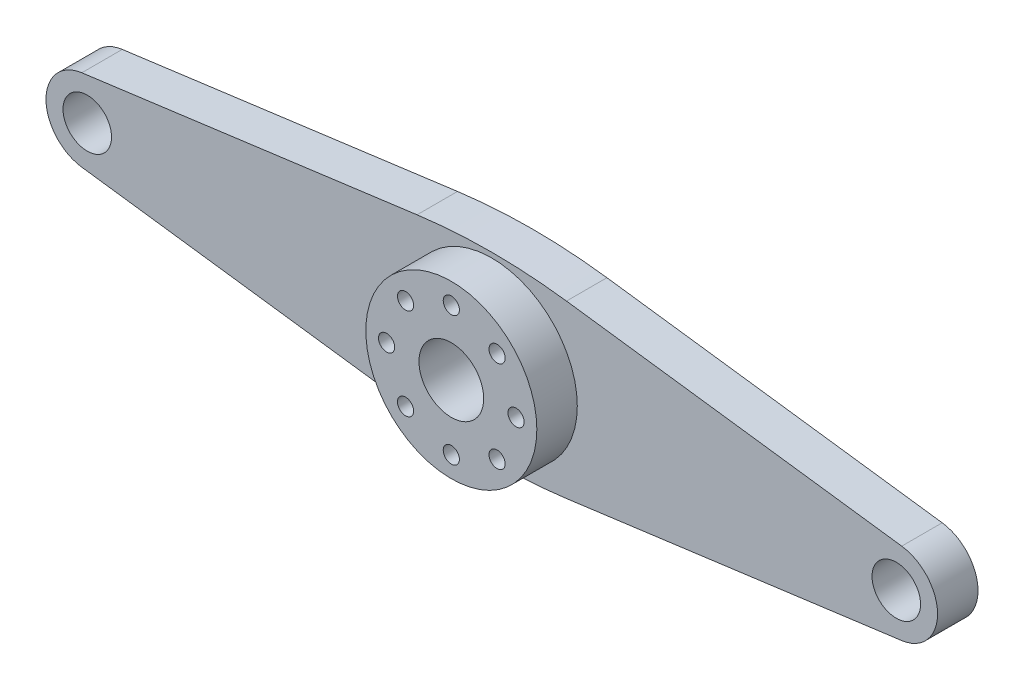
ISO-10303-21;
HEADER;
FILE_DESCRIPTION(('STEP AP214'),'2;1');
FILE_NAME('part.step','',(''),(''),'','','');
FILE_SCHEMA(('AUTOMOTIVE_DESIGN { 1 0 10303 214 1 1 1 1 }'));
ENDSEC;
DATA;
#1=APPLICATION_CONTEXT('core data for automotive mechanical design processes');
#2=APPLICATION_PROTOCOL_DEFINITION('international standard','automotive_design',2000,#1);
#3=PRODUCT_CONTEXT('',#1,'mechanical');
#4=PRODUCT('Part','Part','',(#3));
#5=PRODUCT_RELATED_PRODUCT_CATEGORY('part','',(#4));
#6=PRODUCT_DEFINITION_FORMATION('','',#4);
#7=PRODUCT_DEFINITION_CONTEXT('part definition',#1,'design');
#8=PRODUCT_DEFINITION('design','',#6,#7);
#9=PRODUCT_DEFINITION_SHAPE('','',#8);
#10=(LENGTH_UNIT() NAMED_UNIT(*) SI_UNIT(.MILLI.,.METRE.));
#11=(NAMED_UNIT(*) PLANE_ANGLE_UNIT() SI_UNIT($,.RADIAN.));
#12=(NAMED_UNIT(*) SI_UNIT($,.STERADIAN.) SOLID_ANGLE_UNIT());
#13=UNCERTAINTY_MEASURE_WITH_UNIT(LENGTH_MEASURE(1.E-05),#10,'distance_accuracy_value','');
#14=(GEOMETRIC_REPRESENTATION_CONTEXT(3) GLOBAL_UNCERTAINTY_ASSIGNED_CONTEXT((#13)) GLOBAL_UNIT_ASSIGNED_CONTEXT((#10,
#11,#12)) REPRESENTATION_CONTEXT('',''));
#15=CARTESIAN_POINT('',(0.,0.,0.));
#16=DIRECTION('',(0.,0.,1.));
#17=DIRECTION('',(1.,0.,0.));
#18=AXIS2_PLACEMENT_3D('',#15,#16,#17);
#19=CARTESIAN_POINT('',(-1.54315479575544,-11.5945134987938,5.));
#20=DIRECTION('',(0.131930166805804,0.991259013117456,0.));
#21=DIRECTION('',(-0.991259013117456,0.131930166805804,0.));
#22=AXIS2_PLACEMENT_3D('',#19,#20,#21);
#23=PLANE('',#22);
#24=DIRECTION('',(0.991259013117456,-0.131930166805804,0.));
#25=VECTOR('',#24,1.);
#26=CARTESIAN_POINT('',(-1.54315479575544,-11.5945134987938,0.));
#27=LINE('',#26,#25);
#28=CARTESIAN_POINT('',(-50.6728763500851,-5.05566515137672,0.));
#29=VERTEX_POINT('',#28);
#30=CARTESIAN_POINT('',(-9.23511167640649,-10.5707637614413,0.));
#31=VERTEX_POINT('',#30);
#32=EDGE_CURVE('E137',#29,#31,#27,.T.);
#33=ORIENTED_EDGE('',*,*,#32,.T.);
#34=DIRECTION('',(0.,0.,-1.));
#35=VECTOR('',#34,1.);
#36=CARTESIAN_POINT('',(-9.23511167640649,-10.5707637614413,5.));
#37=LINE('',#36,#35);
#38=CARTESIAN_POINT('',(-9.23511167640649,-10.5707637614413,5.));
#39=VERTEX_POINT('',#38);
#40=EDGE_CURVE('E11',#39,#31,#37,.T.);
#41=ORIENTED_EDGE('',*,*,#40,.F.);
#42=DIRECTION('',(0.991259013117456,-0.131930166805804,0.));
#43=VECTOR('',#42,1.);
#44=CARTESIAN_POINT('',(-1.54315479575544,-11.5945134987938,5.));
#45=LINE('',#44,#43);
#46=CARTESIAN_POINT('',(-50.6728763500851,-5.05566515137672,5.));
#47=VERTEX_POINT('',#46);
#48=EDGE_CURVE('E210',#47,#39,#45,.T.);
#49=ORIENTED_EDGE('',*,*,#48,.F.);
#50=DIRECTION('',(0.,0.,-1.));
#51=VECTOR('',#50,1.);
#52=CARTESIAN_POINT('',(-50.6728763500851,-5.05566515137672,5.));
#53=LINE('',#52,#51);
#54=EDGE_CURVE('E126',#47,#29,#53,.T.);
#55=ORIENTED_EDGE('',*,*,#54,.T.);
#56=EDGE_LOOP('',(#33,#41,#49,#55));
#57=FACE_BOUND('',#56,.T.);
#58=ADVANCED_FACE('F34',(#57),#23,.F.);
#59=CARTESIAN_POINT('',(0.,58.8173671567806,5.));
#60=DIRECTION('',(0.,0.,-1.));
#61=DIRECTION('',(-1.,0.,0.));
#62=AXIS2_PLACEMENT_3D('',#59,#60,#61);
#63=CYLINDRICAL_SURFACE('',#62,70.);
#64=CARTESIAN_POINT('',(0.,58.8173671567806,0.));
#65=DIRECTION('',(0.,0.,1.));
#66=DIRECTION('',(1.,0.,0.));
#67=AXIS2_PLACEMENT_3D('',#64,#65,#66);
#68=CIRCLE('',#67,70.);
#69=CARTESIAN_POINT('',(9.23511167640649,-10.5707637614413,0.));
#70=VERTEX_POINT('',#69);
#71=EDGE_CURVE('E140',#31,#70,#68,.T.);
#72=ORIENTED_EDGE('',*,*,#71,.T.);
#73=DIRECTION('',(0.,0.,-1.));
#74=VECTOR('',#73,1.);
#75=CARTESIAN_POINT('',(9.23511167640649,-10.5707637614413,5.));
#76=LINE('',#75,#74);
#77=CARTESIAN_POINT('',(9.23511167640649,-10.5707637614413,5.));
#78=VERTEX_POINT('',#77);
#79=EDGE_CURVE('E43',#78,#70,#76,.T.);
#80=ORIENTED_EDGE('',*,*,#79,.F.);
#81=CARTESIAN_POINT('',(0.,58.8173671567806,5.));
#82=DIRECTION('',(0.,0.,1.));
#83=DIRECTION('',(1.,0.,0.));
#84=AXIS2_PLACEMENT_3D('',#81,#82,#83);
#85=CIRCLE('',#84,70.);
#86=EDGE_CURVE('E90',#39,#78,#85,.T.);
#87=ORIENTED_EDGE('',*,*,#86,.F.);
#88=ORIENTED_EDGE('',*,*,#40,.T.);
#89=EDGE_LOOP('',(#72,#80,#87,#88));
#90=FACE_BOUND('',#89,.T.);
#91=ADVANCED_FACE('F196',(#90),#63,.T.);
#92=CARTESIAN_POINT('',(1.54315479575544,-11.5945134987938,5.));
#93=DIRECTION('',(0.131930166805804,-0.991259013117456,0.));
#94=DIRECTION('',(0.991259013117456,0.131930166805804,0.));
#95=AXIS2_PLACEMENT_3D('',#92,#93,#94);
#96=PLANE('',#95);
#97=DIRECTION('',(-0.991259013117456,-0.131930166805804,0.));
#98=VECTOR('',#97,1.);
#99=CARTESIAN_POINT('',(1.54315479575544,-11.5945134987938,0.));
#100=LINE('',#99,#98);
#101=CARTESIAN_POINT('',(50.6728763500851,-5.05566515137672,0.));
#102=VERTEX_POINT('',#101);
#103=EDGE_CURVE('E143',#102,#70,#100,.T.);
#104=ORIENTED_EDGE('',*,*,#103,.F.);
#105=DIRECTION('',(0.,0.,-1.));
#106=VECTOR('',#105,1.);
#107=CARTESIAN_POINT('',(50.6728763500851,-5.05566515137672,5.));
#108=LINE('',#107,#106);
#109=CARTESIAN_POINT('',(50.6728763500851,-5.05566515137672,5.));
#110=VERTEX_POINT('',#109);
#111=EDGE_CURVE('E189',#110,#102,#108,.T.);
#112=ORIENTED_EDGE('',*,*,#111,.F.);
#113=DIRECTION('',(-0.991259013117456,-0.131930166805804,0.));
#114=VECTOR('',#113,1.);
#115=CARTESIAN_POINT('',(1.54315479575544,-11.5945134987938,5.));
#116=LINE('',#115,#114);
#117=EDGE_CURVE('E195',#110,#78,#116,.T.);
#118=ORIENTED_EDGE('',*,*,#117,.T.);
#119=ORIENTED_EDGE('',*,*,#79,.T.);
#120=EDGE_LOOP('',(#104,#112,#118,#119));
#121=FACE_BOUND('',#120,.T.);
#122=ADVANCED_FACE('F193',(#121),#96,.T.);
#123=CARTESIAN_POINT('',(50.,0.,5.));
#124=DIRECTION('',(0.,0.,-1.));
#125=DIRECTION('',(-1.,0.,0.));
#126=AXIS2_PLACEMENT_3D('',#123,#124,#125);
#127=CYLINDRICAL_SURFACE('',#126,5.10024633771241);
#128=CARTESIAN_POINT('',(50.,0.,0.));
#129=DIRECTION('',(0.,0.,1.));
#130=DIRECTION('',(1.,0.,0.));
#131=AXIS2_PLACEMENT_3D('',#128,#129,#130);
#132=CIRCLE('',#131,5.10024633771241);
#133=CARTESIAN_POINT('',(50.6728763500851,5.05566515137672,0.));
#134=VERTEX_POINT('',#133);
#135=EDGE_CURVE('E146',#134,#102,#132,.F.);
#136=ORIENTED_EDGE('',*,*,#135,.F.);
#137=DIRECTION('',(0.,0.,-1.));
#138=VECTOR('',#137,1.);
#139=CARTESIAN_POINT('',(50.6728763500851,5.05566515137672,5.));
#140=LINE('',#139,#138);
#141=CARTESIAN_POINT('',(50.6728763500851,5.05566515137672,5.));
#142=VERTEX_POINT('',#141);
#143=EDGE_CURVE('E187',#142,#134,#140,.T.);
#144=ORIENTED_EDGE('',*,*,#143,.F.);
#145=CARTESIAN_POINT('',(50.,0.,5.));
#146=DIRECTION('',(0.,0.,1.));
#147=DIRECTION('',(1.,0.,0.));
#148=AXIS2_PLACEMENT_3D('',#145,#146,#147);
#149=CIRCLE('',#148,5.10024633771241);
#150=EDGE_CURVE('E207',#142,#110,#149,.F.);
#151=ORIENTED_EDGE('',*,*,#150,.T.);
#152=ORIENTED_EDGE('',*,*,#111,.T.);
#153=EDGE_LOOP('',(#136,#144,#151,#152));
#154=FACE_BOUND('',#153,.T.);
#155=ADVANCED_FACE('F205',(#154),#127,.T.);
#156=CARTESIAN_POINT('',(1.54315479575544,11.5945134987938,5.));
#157=DIRECTION('',(-0.131930166805804,-0.991259013117456,0.));
#158=DIRECTION('',(0.991259013117456,-0.131930166805804,0.));
#159=AXIS2_PLACEMENT_3D('',#156,#157,#158);
#160=PLANE('',#159);
#161=DIRECTION('',(-0.991259013117456,0.131930166805804,0.));
#162=VECTOR('',#161,1.);
#163=CARTESIAN_POINT('',(1.54315479575544,11.5945134987938,0.));
#164=LINE('',#163,#162);
#165=CARTESIAN_POINT('',(9.23511167640649,10.5707637614413,0.));
#166=VERTEX_POINT('',#165);
#167=EDGE_CURVE('E149',#134,#166,#164,.T.);
#168=ORIENTED_EDGE('',*,*,#167,.T.);
#169=DIRECTION('',(0.,0.,-1.));
#170=VECTOR('',#169,1.);
#171=CARTESIAN_POINT('',(9.23511167640649,10.5707637614413,5.));
#172=LINE('',#171,#170);
#173=CARTESIAN_POINT('',(9.23511167640649,10.5707637614413,5.));
#174=VERTEX_POINT('',#173);
#175=EDGE_CURVE('E115',#174,#166,#172,.T.);
#176=ORIENTED_EDGE('',*,*,#175,.F.);
#177=DIRECTION('',(-0.991259013117456,0.131930166805804,0.));
#178=VECTOR('',#177,1.);
#179=CARTESIAN_POINT('',(1.54315479575544,11.5945134987938,5.));
#180=LINE('',#179,#178);
#181=EDGE_CURVE('E121',#142,#174,#180,.T.);
#182=ORIENTED_EDGE('',*,*,#181,.F.);
#183=ORIENTED_EDGE('',*,*,#143,.T.);
#184=EDGE_LOOP('',(#168,#176,#182,#183));
#185=FACE_BOUND('',#184,.T.);
#186=ADVANCED_FACE('F355',(#185),#160,.F.);
#187=CARTESIAN_POINT('',(0.,-58.8173671567806,5.));
#188=DIRECTION('',(0.,0.,-1.));
#189=DIRECTION('',(-1.,0.,0.));
#190=AXIS2_PLACEMENT_3D('',#187,#188,#189);
#191=CYLINDRICAL_SURFACE('',#190,70.);
#192=CARTESIAN_POINT('',(0.,-58.8173671567806,0.));
#193=DIRECTION('',(0.,0.,1.));
#194=DIRECTION('',(1.,0.,0.));
#195=AXIS2_PLACEMENT_3D('',#192,#193,#194);
#196=CIRCLE('',#195,70.);
#197=CARTESIAN_POINT('',(-9.23511167640649,10.5707637614413,0.));
#198=VERTEX_POINT('',#197);
#199=EDGE_CURVE('E110',#198,#166,#196,.F.);
#200=ORIENTED_EDGE('',*,*,#199,.F.);
#201=DIRECTION('',(0.,0.,-1.));
#202=VECTOR('',#201,1.);
#203=CARTESIAN_POINT('',(-9.23511167640649,10.5707637614413,5.));
#204=LINE('',#203,#202);
#205=CARTESIAN_POINT('',(-9.23511167640649,10.5707637614413,5.));
#206=VERTEX_POINT('',#205);
#207=EDGE_CURVE('E105',#206,#198,#204,.T.);
#208=ORIENTED_EDGE('',*,*,#207,.F.);
#209=CARTESIAN_POINT('',(0.,-58.8173671567806,5.));
#210=DIRECTION('',(0.,0.,1.));
#211=DIRECTION('',(1.,0.,0.));
#212=AXIS2_PLACEMENT_3D('',#209,#210,#211);
#213=CIRCLE('',#212,70.);
#214=EDGE_CURVE('E108',#206,#174,#213,.F.);
#215=ORIENTED_EDGE('',*,*,#214,.T.);
#216=ORIENTED_EDGE('',*,*,#175,.T.);
#217=EDGE_LOOP('',(#200,#208,#215,#216));
#218=FACE_BOUND('',#217,.T.);
#219=ADVANCED_FACE('F107',(#218),#191,.T.);
#220=CARTESIAN_POINT('',(-1.54315479575544,11.5945134987938,5.));
#221=DIRECTION('',(-0.131930166805804,0.991259013117456,0.));
#222=DIRECTION('',(-0.991259013117456,-0.131930166805804,0.));
#223=AXIS2_PLACEMENT_3D('',#220,#221,#222);
#224=PLANE('',#223);
#225=DIRECTION('',(0.991259013117456,0.131930166805804,0.));
#226=VECTOR('',#225,1.);
#227=CARTESIAN_POINT('',(-1.54315479575544,11.5945134987938,0.));
#228=LINE('',#227,#226);
#229=CARTESIAN_POINT('',(-50.6728763500851,5.05566515137672,0.));
#230=VERTEX_POINT('',#229);
#231=EDGE_CURVE('E153',#230,#198,#228,.T.);
#232=ORIENTED_EDGE('',*,*,#231,.F.);
#233=DIRECTION('',(0.,0.,-1.));
#234=VECTOR('',#233,1.);
#235=CARTESIAN_POINT('',(-50.6728763500851,5.05566515137672,5.));
#236=LINE('',#235,#234);
#237=CARTESIAN_POINT('',(-50.6728763500851,5.05566515137672,5.));
#238=VERTEX_POINT('',#237);
#239=EDGE_CURVE('E79',#238,#230,#236,.T.);
#240=ORIENTED_EDGE('',*,*,#239,.F.);
#241=DIRECTION('',(0.991259013117456,0.131930166805804,0.));
#242=VECTOR('',#241,1.);
#243=CARTESIAN_POINT('',(-1.54315479575544,11.5945134987938,5.));
#244=LINE('',#243,#242);
#245=EDGE_CURVE('E118',#238,#206,#244,.T.);
#246=ORIENTED_EDGE('',*,*,#245,.T.);
#247=ORIENTED_EDGE('',*,*,#207,.T.);
#248=EDGE_LOOP('',(#232,#240,#246,#247));
#249=FACE_BOUND('',#248,.T.);
#250=ADVANCED_FACE('F124',(#249),#224,.T.);
#251=CARTESIAN_POINT('',(0.,-8.,5.));
#252=DIRECTION('',(0.,0.,-1.));
#253=DIRECTION('',(-1.,0.,0.));
#254=AXIS2_PLACEMENT_3D('',#251,#252,#253);
#255=CYLINDRICAL_SURFACE('',#254,1.);
#256=CARTESIAN_POINT('',(0.,-8.,0.));
#257=DIRECTION('',(0.,0.,1.));
#258=DIRECTION('',(1.,0.,0.));
#259=AXIS2_PLACEMENT_3D('',#256,#257,#258);
#260=CIRCLE('',#259,1.);
#261=CARTESIAN_POINT('',(0.999999999999915,-8.,0.));
#262=VERTEX_POINT('',#261);
#263=EDGE_CURVE('E177',#262,#262,#260,.T.);
#264=ORIENTED_EDGE('',*,*,#263,.F.);
#265=EDGE_LOOP('',(#264));
#266=FACE_BOUND('',#265,.T.);
#267=CARTESIAN_POINT('',(0.,-8.,10.));
#268=DIRECTION('',(0.,0.,1.));
#269=DIRECTION('',(1.,0.,0.));
#270=AXIS2_PLACEMENT_3D('',#267,#268,#269);
#271=CIRCLE('',#270,1.);
#272=CARTESIAN_POINT('',(0.999999999999915,-8.,10.));
#273=VERTEX_POINT('',#272);
#274=EDGE_CURVE('E227',#273,#273,#271,.T.);
#275=ORIENTED_EDGE('',*,*,#274,.T.);
#276=EDGE_LOOP('',(#275));
#277=FACE_BOUND('',#276,.T.);
#278=ADVANCED_FACE('F320',(#266,#277),#255,.F.);
#279=CARTESIAN_POINT('',(5.65685424949233,-5.65685424949243,5.));
#280=DIRECTION('',(0.,0.,-1.));
#281=DIRECTION('',(-1.,0.,0.));
#282=AXIS2_PLACEMENT_3D('',#279,#280,#281);
#283=CYLINDRICAL_SURFACE('',#282,1.);
#284=CARTESIAN_POINT('',(5.65685424949233,-5.65685424949243,0.));
#285=DIRECTION('',(0.,0.,1.));
#286=DIRECTION('',(1.,0.,0.));
#287=AXIS2_PLACEMENT_3D('',#284,#285,#286);
#288=CIRCLE('',#287,1.);
#289=CARTESIAN_POINT('',(6.65685424949233,-5.65685424949243,0.));
#290=VERTEX_POINT('',#289);
#291=EDGE_CURVE('E174',#290,#290,#288,.T.);
#292=ORIENTED_EDGE('',*,*,#291,.F.);
#293=EDGE_LOOP('',(#292));
#294=FACE_BOUND('',#293,.T.);
#295=CARTESIAN_POINT('',(5.65685424949233,-5.65685424949243,10.));
#296=DIRECTION('',(0.,0.,1.));
#297=DIRECTION('',(1.,0.,0.));
#298=AXIS2_PLACEMENT_3D('',#295,#296,#297);
#299=CIRCLE('',#298,1.);
#300=CARTESIAN_POINT('',(6.65685424949233,-5.65685424949243,10.));
#301=VERTEX_POINT('',#300);
#302=EDGE_CURVE('E230',#301,#301,#299,.T.);
#303=ORIENTED_EDGE('',*,*,#302,.T.);
#304=EDGE_LOOP('',(#303));
#305=FACE_BOUND('',#304,.T.);
#306=ADVANCED_FACE('F323',(#294,#305),#283,.F.);
#307=CARTESIAN_POINT('',(8.,0.,5.));
#308=DIRECTION('',(0.,0.,-1.));
#309=DIRECTION('',(-1.,0.,0.));
#310=AXIS2_PLACEMENT_3D('',#307,#308,#309);
#311=CYLINDRICAL_SURFACE('',#310,0.999999999999999);
#312=CARTESIAN_POINT('',(8.,0.,0.));
#313=DIRECTION('',(0.,0.,1.));
#314=DIRECTION('',(1.,0.,0.));
#315=AXIS2_PLACEMENT_3D('',#312,#313,#314);
#316=CIRCLE('',#315,0.999999999999999);
#317=CARTESIAN_POINT('',(9.,0.,0.));
#318=VERTEX_POINT('',#317);
#319=EDGE_CURVE('E171',#318,#318,#316,.T.);
#320=ORIENTED_EDGE('',*,*,#319,.F.);
#321=EDGE_LOOP('',(#320));
#322=FACE_BOUND('',#321,.T.);
#323=CARTESIAN_POINT('',(8.,0.,10.));
#324=DIRECTION('',(0.,0.,1.));
#325=DIRECTION('',(1.,0.,0.));
#326=AXIS2_PLACEMENT_3D('',#323,#324,#325);
#327=CIRCLE('',#326,0.999999999999999);
#328=CARTESIAN_POINT('',(9.,0.,10.));
#329=VERTEX_POINT('',#328);
#330=EDGE_CURVE('E233',#329,#329,#327,.T.);
#331=ORIENTED_EDGE('',*,*,#330,.T.);
#332=EDGE_LOOP('',(#331));
#333=FACE_BOUND('',#332,.T.);
#334=ADVANCED_FACE('F327',(#322,#333),#311,.F.);
#335=CARTESIAN_POINT('',(5.65685424949241,5.65685424949235,5.));
#336=DIRECTION('',(0.,0.,-1.));
#337=DIRECTION('',(-1.,0.,0.));
#338=AXIS2_PLACEMENT_3D('',#335,#336,#337);
#339=CYLINDRICAL_SURFACE('',#338,0.999999999999999);
#340=CARTESIAN_POINT('',(5.65685424949241,5.65685424949235,0.));
#341=DIRECTION('',(0.,0.,1.));
#342=DIRECTION('',(1.,0.,0.));
#343=AXIS2_PLACEMENT_3D('',#340,#341,#342);
#344=CIRCLE('',#343,0.999999999999999);
#345=CARTESIAN_POINT('',(6.65685424949241,5.65685424949235,0.));
#346=VERTEX_POINT('',#345);
#347=EDGE_CURVE('E168',#346,#346,#344,.T.);
#348=ORIENTED_EDGE('',*,*,#347,.F.);
#349=EDGE_LOOP('',(#348));
#350=FACE_BOUND('',#349,.T.);
#351=CARTESIAN_POINT('',(5.65685424949241,5.65685424949235,10.));
#352=DIRECTION('',(0.,0.,1.));
#353=DIRECTION('',(1.,0.,0.));
#354=AXIS2_PLACEMENT_3D('',#351,#352,#353);
#355=CIRCLE('',#354,0.999999999999999);
#356=CARTESIAN_POINT('',(6.65685424949241,5.65685424949235,10.));
#357=VERTEX_POINT('',#356);
#358=EDGE_CURVE('E236',#357,#357,#355,.T.);
#359=ORIENTED_EDGE('',*,*,#358,.T.);
#360=EDGE_LOOP('',(#359));
#361=FACE_BOUND('',#360,.T.);
#362=ADVANCED_FACE('F331',(#350,#361),#339,.F.);
#363=CARTESIAN_POINT('',(0.,8.,5.));
#364=DIRECTION('',(0.,0.,-1.));
#365=DIRECTION('',(-1.,0.,0.));
#366=AXIS2_PLACEMENT_3D('',#363,#364,#365);
#367=CYLINDRICAL_SURFACE('',#366,1.);
#368=CARTESIAN_POINT('',(0.,8.,0.));
#369=DIRECTION('',(0.,0.,1.));
#370=DIRECTION('',(1.,0.,0.));
#371=AXIS2_PLACEMENT_3D('',#368,#369,#370);
#372=CIRCLE('',#371,1.);
#373=CARTESIAN_POINT('',(1.00000000000003,8.,0.));
#374=VERTEX_POINT('',#373);
#375=EDGE_CURVE('E165',#374,#374,#372,.T.);
#376=ORIENTED_EDGE('',*,*,#375,.F.);
#377=EDGE_LOOP('',(#376));
#378=FACE_BOUND('',#377,.T.);
#379=CARTESIAN_POINT('',(0.,8.,10.));
#380=DIRECTION('',(0.,0.,1.));
#381=DIRECTION('',(1.,0.,0.));
#382=AXIS2_PLACEMENT_3D('',#379,#380,#381);
#383=CIRCLE('',#382,1.);
#384=CARTESIAN_POINT('',(1.00000000000003,8.,10.));
#385=VERTEX_POINT('',#384);
#386=EDGE_CURVE('E239',#385,#385,#383,.T.);
#387=ORIENTED_EDGE('',*,*,#386,.T.);
#388=EDGE_LOOP('',(#387));
#389=FACE_BOUND('',#388,.T.);
#390=ADVANCED_FACE('F335',(#378,#389),#367,.F.);
#391=CARTESIAN_POINT('',(-8.,0.,5.));
#392=DIRECTION('',(0.,0.,-1.));
#393=DIRECTION('',(-1.,0.,0.));
#394=AXIS2_PLACEMENT_3D('',#391,#392,#393);
#395=CYLINDRICAL_SURFACE('',#394,1.);
#396=CARTESIAN_POINT('',(-8.,0.,0.));
#397=DIRECTION('',(0.,0.,1.));
#398=DIRECTION('',(1.,0.,0.));
#399=AXIS2_PLACEMENT_3D('',#396,#397,#398);
#400=CIRCLE('',#399,1.);
#401=CARTESIAN_POINT('',(-7.,0.,0.));
#402=VERTEX_POINT('',#401);
#403=EDGE_CURVE('E162',#402,#402,#400,.T.);
#404=ORIENTED_EDGE('',*,*,#403,.F.);
#405=EDGE_LOOP('',(#404));
#406=FACE_BOUND('',#405,.T.);
#407=CARTESIAN_POINT('',(-8.,0.,10.));
#408=DIRECTION('',(0.,0.,1.));
#409=DIRECTION('',(1.,0.,0.));
#410=AXIS2_PLACEMENT_3D('',#407,#408,#409);
#411=CIRCLE('',#410,1.);
#412=CARTESIAN_POINT('',(-7.,0.,10.));
#413=VERTEX_POINT('',#412);
#414=EDGE_CURVE('E242',#413,#413,#411,.T.);
#415=ORIENTED_EDGE('',*,*,#414,.T.);
#416=EDGE_LOOP('',(#415));
#417=FACE_BOUND('',#416,.T.);
#418=ADVANCED_FACE('F339',(#406,#417),#395,.F.);
#419=CARTESIAN_POINT('',(-5.65685424949237,5.65685424949239,5.));
#420=DIRECTION('',(0.,0.,-1.));
#421=DIRECTION('',(-1.,0.,0.));
#422=AXIS2_PLACEMENT_3D('',#419,#420,#421);
#423=CYLINDRICAL_SURFACE('',#422,0.999999999999999);
#424=CARTESIAN_POINT('',(-5.65685424949237,5.65685424949239,0.));
#425=DIRECTION('',(0.,0.,1.));
#426=DIRECTION('',(1.,0.,0.));
#427=AXIS2_PLACEMENT_3D('',#424,#425,#426);
#428=CIRCLE('',#427,0.999999999999999);
#429=CARTESIAN_POINT('',(-4.65685424949237,5.65685424949239,0.));
#430=VERTEX_POINT('',#429);
#431=EDGE_CURVE('E159',#430,#430,#428,.T.);
#432=ORIENTED_EDGE('',*,*,#431,.F.);
#433=EDGE_LOOP('',(#432));
#434=FACE_BOUND('',#433,.T.);
#435=CARTESIAN_POINT('',(-5.65685424949237,5.65685424949239,10.));
#436=DIRECTION('',(0.,0.,1.));
#437=DIRECTION('',(1.,0.,0.));
#438=AXIS2_PLACEMENT_3D('',#435,#436,#437);
#439=CIRCLE('',#438,0.999999999999999);
#440=CARTESIAN_POINT('',(-4.65685424949237,5.65685424949239,10.));
#441=VERTEX_POINT('',#440);
#442=EDGE_CURVE('E245',#441,#441,#439,.T.);
#443=ORIENTED_EDGE('',*,*,#442,.T.);
#444=EDGE_LOOP('',(#443));
#445=FACE_BOUND('',#444,.T.);
#446=ADVANCED_FACE('F343',(#434,#445),#423,.F.);
#447=CARTESIAN_POINT('',(0.,0.,5.));
#448=DIRECTION('',(0.,0.,-1.));
#449=DIRECTION('',(-1.,0.,0.));
#450=AXIS2_PLACEMENT_3D('',#447,#448,#449);
#451=CYLINDRICAL_SURFACE('',#450,4.);
#452=CARTESIAN_POINT('',(0.,0.,0.));
#453=DIRECTION('',(0.,0.,1.));
#454=DIRECTION('',(1.,0.,0.));
#455=AXIS2_PLACEMENT_3D('',#452,#453,#454);
#456=CIRCLE('',#455,4.);
#457=CARTESIAN_POINT('',(4.,0.,0.));
#458=VERTEX_POINT('',#457);
#459=EDGE_CURVE('E156',#458,#458,#456,.T.);
#460=ORIENTED_EDGE('',*,*,#459,.F.);
#461=EDGE_LOOP('',(#460));
#462=FACE_BOUND('',#461,.T.);
#463=CARTESIAN_POINT('',(0.,0.,10.));
#464=DIRECTION('',(0.,0.,1.));
#465=DIRECTION('',(1.,0.,0.));
#466=AXIS2_PLACEMENT_3D('',#463,#464,#465);
#467=CIRCLE('',#466,4.);
#468=CARTESIAN_POINT('',(4.,0.,10.));
#469=VERTEX_POINT('',#468);
#470=EDGE_CURVE('E248',#469,#469,#467,.T.);
#471=ORIENTED_EDGE('',*,*,#470,.T.);
#472=EDGE_LOOP('',(#471));
#473=FACE_BOUND('',#472,.T.);
#474=ADVANCED_FACE('F252',(#462,#473),#451,.F.);
#475=CARTESIAN_POINT('',(-50.,0.,5.));
#476=DIRECTION('',(0.,0.,-1.));
#477=DIRECTION('',(-1.,0.,0.));
#478=AXIS2_PLACEMENT_3D('',#475,#476,#477);
#479=CYLINDRICAL_SURFACE('',#478,5.10024633771241);
#480=CARTESIAN_POINT('',(-50.,0.,0.));
#481=DIRECTION('',(0.,0.,1.));
#482=DIRECTION('',(1.,0.,0.));
#483=AXIS2_PLACEMENT_3D('',#480,#481,#482);
#484=CIRCLE('',#483,5.10024633771241);
#485=EDGE_CURVE('E82',#230,#29,#484,.T.);
#486=ORIENTED_EDGE('',*,*,#485,.T.);
#487=ORIENTED_EDGE('',*,*,#54,.F.);
#488=CARTESIAN_POINT('',(-50.,0.,5.));
#489=DIRECTION('',(0.,0.,1.));
#490=DIRECTION('',(1.,0.,0.));
#491=AXIS2_PLACEMENT_3D('',#488,#489,#490);
#492=CIRCLE('',#491,5.10024633771241);
#493=EDGE_CURVE('E51',#238,#47,#492,.T.);
#494=ORIENTED_EDGE('',*,*,#493,.F.);
#495=ORIENTED_EDGE('',*,*,#239,.T.);
#496=EDGE_LOOP('',(#486,#487,#494,#495));
#497=FACE_BOUND('',#496,.T.);
#498=ADVANCED_FACE('F297',(#497),#479,.T.);
#499=CARTESIAN_POINT('',(-50.,0.,5.));
#500=DIRECTION('',(0.,0.,-1.));
#501=DIRECTION('',(-1.,0.,0.));
#502=AXIS2_PLACEMENT_3D('',#499,#500,#501);
#503=CYLINDRICAL_SURFACE('',#502,3.);
#504=CARTESIAN_POINT('',(-50.,0.,5.));
#505=DIRECTION('',(0.,0.,1.));
#506=DIRECTION('',(1.,0.,0.));
#507=AXIS2_PLACEMENT_3D('',#504,#505,#506);
#508=CIRCLE('',#507,3.);
#509=CARTESIAN_POINT('',(-47.,0.,5.));
#510=VERTEX_POINT('',#509);
#511=EDGE_CURVE('E214',#510,#510,#508,.T.);
#512=ORIENTED_EDGE('',*,*,#511,.T.);
#513=EDGE_LOOP('',(#512));
#514=FACE_BOUND('',#513,.T.);
#515=CARTESIAN_POINT('',(-50.,0.,0.));
#516=DIRECTION('',(0.,0.,1.));
#517=DIRECTION('',(1.,0.,0.));
#518=AXIS2_PLACEMENT_3D('',#515,#516,#517);
#519=CIRCLE('',#518,3.);
#520=CARTESIAN_POINT('',(-47.,0.,0.));
#521=VERTEX_POINT('',#520);
#522=EDGE_CURVE('E133',#521,#521,#519,.T.);
#523=ORIENTED_EDGE('',*,*,#522,.F.);
#524=EDGE_LOOP('',(#523));
#525=FACE_BOUND('',#524,.T.);
#526=ADVANCED_FACE('F295',(#514,#525),#503,.F.);
#527=CARTESIAN_POINT('',(50.,0.,5.));
#528=DIRECTION('',(0.,0.,-1.));
#529=DIRECTION('',(-1.,0.,0.));
#530=AXIS2_PLACEMENT_3D('',#527,#528,#529);
#531=CYLINDRICAL_SURFACE('',#530,3.);
#532=CARTESIAN_POINT('',(50.,0.,5.));
#533=DIRECTION('',(0.,0.,1.));
#534=DIRECTION('',(1.,0.,0.));
#535=AXIS2_PLACEMENT_3D('',#532,#533,#534);
#536=CIRCLE('',#535,3.);
#537=CARTESIAN_POINT('',(53.,0.,5.));
#538=VERTEX_POINT('',#537);
#539=EDGE_CURVE('E183',#538,#538,#536,.F.);
#540=ORIENTED_EDGE('',*,*,#539,.F.);
#541=EDGE_LOOP('',(#540));
#542=FACE_BOUND('',#541,.T.);
#543=CARTESIAN_POINT('',(50.,0.,0.));
#544=DIRECTION('',(0.,0.,1.));
#545=DIRECTION('',(1.,0.,0.));
#546=AXIS2_PLACEMENT_3D('',#543,#544,#545);
#547=CIRCLE('',#546,3.);
#548=CARTESIAN_POINT('',(53.,0.,0.));
#549=VERTEX_POINT('',#548);
#550=EDGE_CURVE('E130',#549,#549,#547,.F.);
#551=ORIENTED_EDGE('',*,*,#550,.T.);
#552=EDGE_LOOP('',(#551));
#553=FACE_BOUND('',#552,.T.);
#554=ADVANCED_FACE('F36',(#542,#553),#531,.F.);
#555=CARTESIAN_POINT('',(-5.65685424949245,-5.65685424949231,5.));
#556=DIRECTION('',(0.,0.,-1.));
#557=DIRECTION('',(-1.,0.,0.));
#558=AXIS2_PLACEMENT_3D('',#555,#556,#557);
#559=CYLINDRICAL_SURFACE('',#558,1.);
#560=CARTESIAN_POINT('',(-5.65685424949245,-5.65685424949231,0.));
#561=DIRECTION('',(0.,0.,1.));
#562=DIRECTION('',(1.,0.,0.));
#563=AXIS2_PLACEMENT_3D('',#560,#561,#562);
#564=CIRCLE('',#563,1.);
#565=CARTESIAN_POINT('',(-4.65685424949245,-5.65685424949231,0.));
#566=VERTEX_POINT('',#565);
#567=EDGE_CURVE('E180',#566,#566,#564,.T.);
#568=ORIENTED_EDGE('',*,*,#567,.F.);
#569=EDGE_LOOP('',(#568));
#570=FACE_BOUND('',#569,.T.);
#571=CARTESIAN_POINT('',(-5.65685424949245,-5.65685424949231,10.));
#572=DIRECTION('',(0.,0.,1.));
#573=DIRECTION('',(1.,0.,0.));
#574=AXIS2_PLACEMENT_3D('',#571,#572,#573);
#575=CIRCLE('',#574,1.);
#576=CARTESIAN_POINT('',(-4.65685424949245,-5.65685424949231,10.));
#577=VERTEX_POINT('',#576);
#578=EDGE_CURVE('E224',#577,#577,#575,.T.);
#579=ORIENTED_EDGE('',*,*,#578,.T.);
#580=EDGE_LOOP('',(#579));
#581=FACE_BOUND('',#580,.T.);
#582=ADVANCED_FACE('F303',(#570,#581),#559,.F.);
#583=CARTESIAN_POINT('',(0.,0.,5.));
#584=DIRECTION('',(0.,0.,1.));
#585=DIRECTION('',(1.,0.,0.));
#586=AXIS2_PLACEMENT_3D('',#583,#584,#585);
#587=PLANE('',#586);
#588=CARTESIAN_POINT('',(0.,0.,5.));
#589=DIRECTION('',(0.,0.,1.));
#590=DIRECTION('',(1.,0.,0.));
#591=AXIS2_PLACEMENT_3D('',#588,#589,#590);
#592=CIRCLE('',#591,10.5707637614413);
#593=CARTESIAN_POINT('',(10.5707637614413,0.,5.));
#594=VERTEX_POINT('',#593);
#595=EDGE_CURVE('E134',#594,#594,#592,.F.);
#596=ORIENTED_EDGE('',*,*,#595,.T.);
#597=EDGE_LOOP('',(#596));
#598=FACE_BOUND('',#597,.T.);
#599=ORIENTED_EDGE('',*,*,#539,.T.);
#600=EDGE_LOOP('',(#599));
#601=FACE_BOUND('',#600,.T.);
#602=ORIENTED_EDGE('',*,*,#511,.F.);
#603=EDGE_LOOP('',(#602));
#604=FACE_BOUND('',#603,.T.);
#605=ORIENTED_EDGE('',*,*,#48,.T.);
#606=ORIENTED_EDGE('',*,*,#86,.T.);
#607=ORIENTED_EDGE('',*,*,#117,.F.);
#608=ORIENTED_EDGE('',*,*,#150,.F.);
#609=ORIENTED_EDGE('',*,*,#181,.T.);
#610=ORIENTED_EDGE('',*,*,#214,.F.);
#611=ORIENTED_EDGE('',*,*,#245,.F.);
#612=ORIENTED_EDGE('',*,*,#493,.T.);
#613=EDGE_LOOP('',(#605,#606,#607,#608,#609,#610,#611,#612));
#614=FACE_BOUND('',#613,.T.);
#615=ADVANCED_FACE('F117',(#598,#601,#604,#614),#587,.T.);
#616=CARTESIAN_POINT('',(0.,0.,0.));
#617=DIRECTION('',(0.,0.,1.));
#618=DIRECTION('',(1.,0.,0.));
#619=AXIS2_PLACEMENT_3D('',#616,#617,#618);
#620=PLANE('',#619);
#621=ORIENTED_EDGE('',*,*,#550,.F.);
#622=EDGE_LOOP('',(#621));
#623=FACE_BOUND('',#622,.T.);
#624=ORIENTED_EDGE('',*,*,#522,.T.);
#625=EDGE_LOOP('',(#624));
#626=FACE_BOUND('',#625,.T.);
#627=ORIENTED_EDGE('',*,*,#32,.F.);
#628=ORIENTED_EDGE('',*,*,#485,.F.);
#629=ORIENTED_EDGE('',*,*,#231,.T.);
#630=ORIENTED_EDGE('',*,*,#199,.T.);
#631=ORIENTED_EDGE('',*,*,#167,.F.);
#632=ORIENTED_EDGE('',*,*,#135,.T.);
#633=ORIENTED_EDGE('',*,*,#103,.T.);
#634=ORIENTED_EDGE('',*,*,#71,.F.);
#635=EDGE_LOOP('',(#627,#628,#629,#630,#631,#632,#633,#634));
#636=FACE_BOUND('',#635,.T.);
#637=ORIENTED_EDGE('',*,*,#567,.T.);
#638=EDGE_LOOP('',(#637));
#639=FACE_BOUND('',#638,.T.);
#640=ORIENTED_EDGE('',*,*,#263,.T.);
#641=EDGE_LOOP('',(#640));
#642=FACE_BOUND('',#641,.T.);
#643=ORIENTED_EDGE('',*,*,#291,.T.);
#644=EDGE_LOOP('',(#643));
#645=FACE_BOUND('',#644,.T.);
#646=ORIENTED_EDGE('',*,*,#319,.T.);
#647=EDGE_LOOP('',(#646));
#648=FACE_BOUND('',#647,.T.);
#649=ORIENTED_EDGE('',*,*,#347,.T.);
#650=EDGE_LOOP('',(#649));
#651=FACE_BOUND('',#650,.T.);
#652=ORIENTED_EDGE('',*,*,#375,.T.);
#653=EDGE_LOOP('',(#652));
#654=FACE_BOUND('',#653,.T.);
#655=ORIENTED_EDGE('',*,*,#403,.T.);
#656=EDGE_LOOP('',(#655));
#657=FACE_BOUND('',#656,.T.);
#658=ORIENTED_EDGE('',*,*,#431,.T.);
#659=EDGE_LOOP('',(#658));
#660=FACE_BOUND('',#659,.T.);
#661=ORIENTED_EDGE('',*,*,#459,.T.);
#662=EDGE_LOOP('',(#661));
#663=FACE_BOUND('',#662,.T.);
#664=ADVANCED_FACE('F200',(#623,#626,#636,#639,#642,#645,#648,#651,#654,#657,#660,#663),#620,.F.);
#665=CARTESIAN_POINT('',(0.,0.,10.));
#666=DIRECTION('',(0.,0.,-1.));
#667=DIRECTION('',(-1.,0.,0.));
#668=AXIS2_PLACEMENT_3D('',#665,#666,#667);
#669=CYLINDRICAL_SURFACE('',#668,10.5707637614413);
#670=ORIENTED_EDGE('',*,*,#595,.F.);
#671=EDGE_LOOP('',(#670));
#672=FACE_BOUND('',#671,.T.);
#673=CARTESIAN_POINT('',(0.,0.,10.));
#674=DIRECTION('',(0.,0.,1.));
#675=DIRECTION('',(1.,0.,0.));
#676=AXIS2_PLACEMENT_3D('',#673,#674,#675);
#677=CIRCLE('',#676,10.5707637614413);
#678=CARTESIAN_POINT('',(10.5707637614413,0.,10.));
#679=VERTEX_POINT('',#678);
#680=EDGE_CURVE('E221',#679,#679,#677,.T.);
#681=ORIENTED_EDGE('',*,*,#680,.F.);
#682=EDGE_LOOP('',(#681));
#683=FACE_BOUND('',#682,.T.);
#684=ADVANCED_FACE('F257',(#672,#683),#669,.T.);
#685=CARTESIAN_POINT('',(0.,0.,10.));
#686=DIRECTION('',(0.,0.,1.));
#687=DIRECTION('',(1.,0.,0.));
#688=AXIS2_PLACEMENT_3D('',#685,#686,#687);
#689=PLANE('',#688);
#690=ORIENTED_EDGE('',*,*,#470,.F.);
#691=EDGE_LOOP('',(#690));
#692=FACE_BOUND('',#691,.T.);
#693=ORIENTED_EDGE('',*,*,#442,.F.);
#694=EDGE_LOOP('',(#693));
#695=FACE_BOUND('',#694,.T.);
#696=ORIENTED_EDGE('',*,*,#414,.F.);
#697=EDGE_LOOP('',(#696));
#698=FACE_BOUND('',#697,.T.);
#699=ORIENTED_EDGE('',*,*,#386,.F.);
#700=EDGE_LOOP('',(#699));
#701=FACE_BOUND('',#700,.T.);
#702=ORIENTED_EDGE('',*,*,#358,.F.);
#703=EDGE_LOOP('',(#702));
#704=FACE_BOUND('',#703,.T.);
#705=ORIENTED_EDGE('',*,*,#330,.F.);
#706=EDGE_LOOP('',(#705));
#707=FACE_BOUND('',#706,.T.);
#708=ORIENTED_EDGE('',*,*,#302,.F.);
#709=EDGE_LOOP('',(#708));
#710=FACE_BOUND('',#709,.T.);
#711=ORIENTED_EDGE('',*,*,#274,.F.);
#712=EDGE_LOOP('',(#711));
#713=FACE_BOUND('',#712,.T.);
#714=ORIENTED_EDGE('',*,*,#578,.F.);
#715=EDGE_LOOP('',(#714));
#716=FACE_BOUND('',#715,.T.);
#717=ORIENTED_EDGE('',*,*,#680,.T.);
#718=EDGE_LOOP('',(#717));
#719=FACE_BOUND('',#718,.T.);
#720=ADVANCED_FACE('F254',(#692,#695,#698,#701,#704,#707,#710,#713,#716,#719),#689,.T.);
#721=CLOSED_SHELL('',(#58,#91,#122,#155,#186,#219,#250,#278,#306,#334,#362,#390,#418,#446,#474,
#498,#526,#554,#582,#615,#664,#684,#720));
#722=MANIFOLD_SOLID_BREP('B2',#721);
#723=ADVANCED_BREP_SHAPE_REPRESENTATION('',(#18,#722),#14);
#724=SHAPE_DEFINITION_REPRESENTATION(#9,#723);
ENDSEC;
END-ISO-10303-21;
